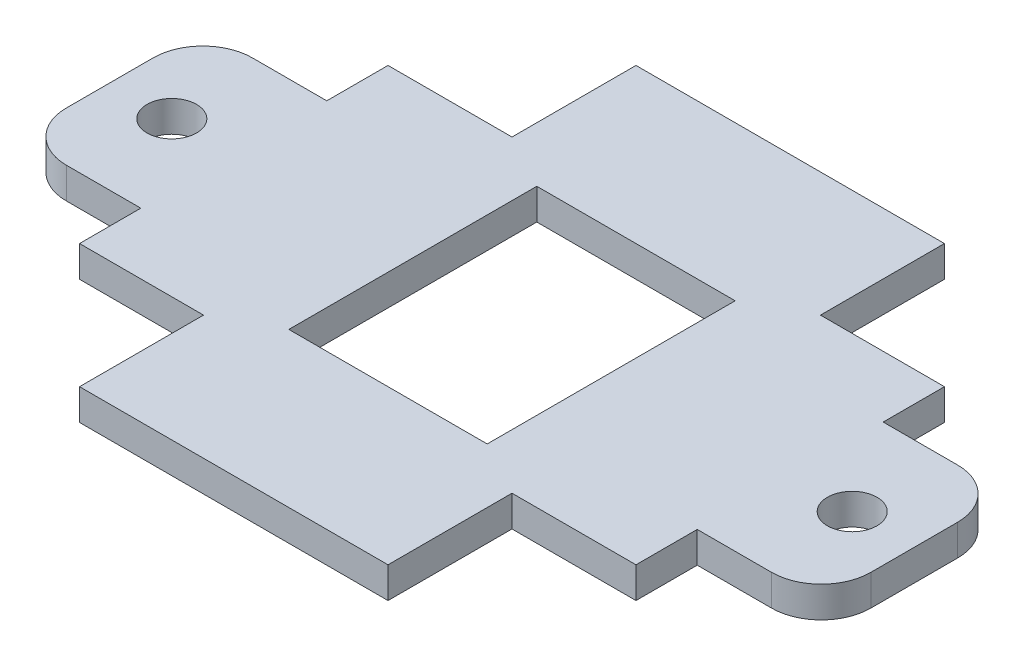
ISO-10303-21;
HEADER;
FILE_DESCRIPTION(('STEP AP214'),'2;1');
FILE_NAME('part.step','',(''),(''),'','','');
FILE_SCHEMA(('AUTOMOTIVE_DESIGN { 1 0 10303 214 1 1 1 1 }'));
ENDSEC;
DATA;
#1=APPLICATION_CONTEXT('core data for automotive mechanical design processes');
#2=APPLICATION_PROTOCOL_DEFINITION('international standard','automotive_design',2000,#1);
#3=PRODUCT_CONTEXT('',#1,'mechanical');
#4=PRODUCT('Part','Part','',(#3));
#5=PRODUCT_RELATED_PRODUCT_CATEGORY('part','',(#4));
#6=PRODUCT_DEFINITION_FORMATION('','',#4);
#7=PRODUCT_DEFINITION_CONTEXT('part definition',#1,'design');
#8=PRODUCT_DEFINITION('design','',#6,#7);
#9=PRODUCT_DEFINITION_SHAPE('','',#8);
#10=(LENGTH_UNIT() NAMED_UNIT(*) SI_UNIT(.MILLI.,.METRE.));
#11=(NAMED_UNIT(*) PLANE_ANGLE_UNIT() SI_UNIT($,.RADIAN.));
#12=(NAMED_UNIT(*) SI_UNIT($,.STERADIAN.) SOLID_ANGLE_UNIT());
#13=UNCERTAINTY_MEASURE_WITH_UNIT(LENGTH_MEASURE(1.E-05),#10,'distance_accuracy_value','');
#14=(GEOMETRIC_REPRESENTATION_CONTEXT(3) GLOBAL_UNCERTAINTY_ASSIGNED_CONTEXT((#13)) GLOBAL_UNIT_ASSIGNED_CONTEXT((#10,
#11,#12)) REPRESENTATION_CONTEXT('',''));
#15=CARTESIAN_POINT('',(0.,0.,0.));
#16=DIRECTION('',(0.,0.,1.));
#17=DIRECTION('',(1.,0.,0.));
#18=AXIS2_PLACEMENT_3D('',#15,#16,#17);
#19=CARTESIAN_POINT('',(-36.1199938,3.175,-4.44499999999998));
#20=DIRECTION('',(0.,1.,0.));
#21=DIRECTION('',(0.,0.,1.));
#22=AXIS2_PLACEMENT_3D('',#19,#20,#21);
#23=PLANE('',#22);
#24=CARTESIAN_POINT('',(-34.8499938,3.175,0.));
#25=DIRECTION('',(0.,1.,0.));
#26=DIRECTION('',(0.,0.,1.));
#27=AXIS2_PLACEMENT_3D('',#24,#25,#26);
#28=CIRCLE('',#27,2.54);
#29=CARTESIAN_POINT('',(-34.8499938,3.175,2.54000000000002));
#30=VERTEX_POINT('',#29);
#31=EDGE_CURVE('E249',#30,#30,#28,.T.);
#32=ORIENTED_EDGE('',*,*,#31,.F.);
#33=EDGE_LOOP('',(#32));
#34=FACE_BOUND('',#33,.T.);
#35=DIRECTION('',(-1.,0.,0.));
#36=VECTOR('',#35,1.);
#37=CARTESIAN_POINT('',(-28.4999938,3.175,-9.52499999999998));
#38=LINE('',#37,#36);
#39=CARTESIAN_POINT('',(-28.4999938,3.175,-9.52499999999998));
#40=VERTEX_POINT('',#39);
#41=CARTESIAN_POINT('',(-36.1199938000001,3.175,-9.52499999999998));
#42=VERTEX_POINT('',#41);
#43=EDGE_CURVE('E259',#40,#42,#38,.T.);
#44=ORIENTED_EDGE('',*,*,#43,.T.);
#45=CARTESIAN_POINT('',(-36.1199938,3.175,-4.44499999999998));
#46=DIRECTION('',(0.,1.,0.));
#47=DIRECTION('',(0.,0.,1.));
#48=AXIS2_PLACEMENT_3D('',#45,#46,#47);
#49=CIRCLE('',#48,5.08);
#50=CARTESIAN_POINT('',(-41.1999938,3.175,-4.44499999999998));
#51=VERTEX_POINT('',#50);
#52=EDGE_CURVE('E262',#42,#51,#49,.T.);
#53=ORIENTED_EDGE('',*,*,#52,.T.);
#54=DIRECTION('',(0.,0.,1.));
#55=VECTOR('',#54,1.);
#56=CARTESIAN_POINT('',(-41.1999938,3.175,4.44500000000002));
#57=LINE('',#56,#55);
#58=CARTESIAN_POINT('',(-41.1999938,3.175,4.44500000000002));
#59=VERTEX_POINT('',#58);
#60=EDGE_CURVE('E265',#51,#59,#57,.T.);
#61=ORIENTED_EDGE('',*,*,#60,.T.);
#62=CARTESIAN_POINT('',(-36.1199938,3.175,4.44500000000002));
#63=DIRECTION('',(0.,1.,0.));
#64=DIRECTION('',(0.,0.,-1.));
#65=AXIS2_PLACEMENT_3D('',#62,#63,#64);
#66=CIRCLE('',#65,5.08);
#67=CARTESIAN_POINT('',(-36.1199938000001,3.175,9.52500000000002));
#68=VERTEX_POINT('',#67);
#69=EDGE_CURVE('E267',#59,#68,#66,.T.);
#70=ORIENTED_EDGE('',*,*,#69,.T.);
#71=DIRECTION('',(1.,0.,0.));
#72=VECTOR('',#71,1.);
#73=CARTESIAN_POINT('',(-28.4999938,3.175,9.52500000000002));
#74=LINE('',#73,#72);
#75=CARTESIAN_POINT('',(-28.4999938,3.175,9.52500000000002));
#76=VERTEX_POINT('',#75);
#77=EDGE_CURVE('E269',#68,#76,#74,.T.);
#78=ORIENTED_EDGE('',*,*,#77,.T.);
#79=DIRECTION('',(0.,0.,1.));
#80=VECTOR('',#79,1.);
#81=CARTESIAN_POINT('',(-28.4999938,3.175,9.52500000000002));
#82=LINE('',#81,#80);
#83=CARTESIAN_POINT('',(-28.4999938,3.175,15.7999938));
#84=VERTEX_POINT('',#83);
#85=EDGE_CURVE('E271',#76,#84,#82,.T.);
#86=ORIENTED_EDGE('',*,*,#85,.T.);
#87=DIRECTION('',(1.,0.,0.));
#88=VECTOR('',#87,1.);
#89=CARTESIAN_POINT('',(-15.7999938,3.175,15.7999938));
#90=LINE('',#89,#88);
#91=CARTESIAN_POINT('',(-15.7999938,3.175,15.7999938));
#92=VERTEX_POINT('',#91);
#93=EDGE_CURVE('E273',#84,#92,#90,.T.);
#94=ORIENTED_EDGE('',*,*,#93,.T.);
#95=DIRECTION('',(0.,0.,1.));
#96=VECTOR('',#95,1.);
#97=CARTESIAN_POINT('',(-15.7999938,3.175,15.7999938));
#98=LINE('',#97,#96);
#99=CARTESIAN_POINT('',(-15.7999938,3.175,28.4999938));
#100=VERTEX_POINT('',#99);
#101=EDGE_CURVE('E275',#92,#100,#98,.T.);
#102=ORIENTED_EDGE('',*,*,#101,.T.);
#103=DIRECTION('',(1.,0.,0.));
#104=VECTOR('',#103,1.);
#105=CARTESIAN_POINT('',(15.7999938,3.175,28.4999938));
#106=LINE('',#105,#104);
#107=CARTESIAN_POINT('',(15.7999938,3.175,28.4999938));
#108=VERTEX_POINT('',#107);
#109=EDGE_CURVE('E277',#100,#108,#106,.T.);
#110=ORIENTED_EDGE('',*,*,#109,.T.);
#111=DIRECTION('',(0.,0.,-1.));
#112=VECTOR('',#111,1.);
#113=CARTESIAN_POINT('',(15.7999938,3.175,15.7999938));
#114=LINE('',#113,#112);
#115=CARTESIAN_POINT('',(15.7999938,3.175,15.7999938));
#116=VERTEX_POINT('',#115);
#117=EDGE_CURVE('E279',#108,#116,#114,.T.);
#118=ORIENTED_EDGE('',*,*,#117,.T.);
#119=DIRECTION('',(1.,0.,0.));
#120=VECTOR('',#119,1.);
#121=CARTESIAN_POINT('',(15.7999938,3.175,15.7999938));
#122=LINE('',#121,#120);
#123=CARTESIAN_POINT('',(28.4999938,3.175,15.7999938));
#124=VERTEX_POINT('',#123);
#125=EDGE_CURVE('E281',#116,#124,#122,.T.);
#126=ORIENTED_EDGE('',*,*,#125,.T.);
#127=DIRECTION('',(0.,0.,-1.));
#128=VECTOR('',#127,1.);
#129=CARTESIAN_POINT('',(28.4999938,3.175,9.52500000000002));
#130=LINE('',#129,#128);
#131=CARTESIAN_POINT('',(28.4999938,3.175,9.52500000000002));
#132=VERTEX_POINT('',#131);
#133=EDGE_CURVE('E283',#124,#132,#130,.T.);
#134=ORIENTED_EDGE('',*,*,#133,.T.);
#135=DIRECTION('',(1.,0.,0.));
#136=VECTOR('',#135,1.);
#137=CARTESIAN_POINT('',(28.4999938,3.175,9.52500000000002));
#138=LINE('',#137,#136);
#139=CARTESIAN_POINT('',(36.1199938,3.175,9.52500000000002));
#140=VERTEX_POINT('',#139);
#141=EDGE_CURVE('E285',#132,#140,#138,.T.);
#142=ORIENTED_EDGE('',*,*,#141,.T.);
#143=CARTESIAN_POINT('',(36.1199938,3.175,4.44500000000002));
#144=DIRECTION('',(0.,1.,0.));
#145=DIRECTION('',(0.,0.,1.));
#146=AXIS2_PLACEMENT_3D('',#143,#144,#145);
#147=CIRCLE('',#146,5.08);
#148=CARTESIAN_POINT('',(41.1999938,3.175,4.44500000000001));
#149=VERTEX_POINT('',#148);
#150=EDGE_CURVE('E287',#140,#149,#147,.T.);
#151=ORIENTED_EDGE('',*,*,#150,.T.);
#152=DIRECTION('',(0.,0.,-1.));
#153=VECTOR('',#152,1.);
#154=CARTESIAN_POINT('',(41.1999938,3.175,4.44500000000001));
#155=LINE('',#154,#153);
#156=CARTESIAN_POINT('',(41.1999938,3.175,-4.44499999999999));
#157=VERTEX_POINT('',#156);
#158=EDGE_CURVE('E289',#149,#157,#155,.T.);
#159=ORIENTED_EDGE('',*,*,#158,.T.);
#160=CARTESIAN_POINT('',(36.1199938,3.175,-4.44499999999999));
#161=DIRECTION('',(0.,1.,0.));
#162=DIRECTION('',(0.,0.,1.));
#163=AXIS2_PLACEMENT_3D('',#160,#161,#162);
#164=CIRCLE('',#163,5.08000000000001);
#165=CARTESIAN_POINT('',(36.1199938,3.175,-9.52499999999999));
#166=VERTEX_POINT('',#165);
#167=EDGE_CURVE('E291',#157,#166,#164,.T.);
#168=ORIENTED_EDGE('',*,*,#167,.T.);
#169=DIRECTION('',(-1.,0.,0.));
#170=VECTOR('',#169,1.);
#171=CARTESIAN_POINT('',(28.4999938,3.175,-9.52499999999998));
#172=LINE('',#171,#170);
#173=CARTESIAN_POINT('',(28.4999938,3.175,-9.52499999999998));
#174=VERTEX_POINT('',#173);
#175=EDGE_CURVE('E293',#166,#174,#172,.T.);
#176=ORIENTED_EDGE('',*,*,#175,.T.);
#177=DIRECTION('',(0.,0.,-1.));
#178=VECTOR('',#177,1.);
#179=CARTESIAN_POINT('',(28.4999938,3.175,-15.7999938));
#180=LINE('',#179,#178);
#181=CARTESIAN_POINT('',(28.4999938,3.175,-15.7999938));
#182=VERTEX_POINT('',#181);
#183=EDGE_CURVE('E295',#174,#182,#180,.T.);
#184=ORIENTED_EDGE('',*,*,#183,.T.);
#185=DIRECTION('',(-1.,0.,0.));
#186=VECTOR('',#185,1.);
#187=CARTESIAN_POINT('',(15.7999938,3.175,-15.7999938));
#188=LINE('',#187,#186);
#189=CARTESIAN_POINT('',(15.7999938,3.175,-15.7999938));
#190=VERTEX_POINT('',#189);
#191=EDGE_CURVE('E297',#182,#190,#188,.T.);
#192=ORIENTED_EDGE('',*,*,#191,.T.);
#193=DIRECTION('',(0.,0.,-1.));
#194=VECTOR('',#193,1.);
#195=CARTESIAN_POINT('',(15.7999938,3.175,-15.7999938));
#196=LINE('',#195,#194);
#197=CARTESIAN_POINT('',(15.7999938,3.175,-28.4999938));
#198=VERTEX_POINT('',#197);
#199=EDGE_CURVE('E299',#190,#198,#196,.T.);
#200=ORIENTED_EDGE('',*,*,#199,.T.);
#201=DIRECTION('',(-1.,0.,0.));
#202=VECTOR('',#201,1.);
#203=CARTESIAN_POINT('',(-15.7999938,3.175,-28.4999938));
#204=LINE('',#203,#202);
#205=CARTESIAN_POINT('',(-15.7999938,3.175,-28.4999938));
#206=VERTEX_POINT('',#205);
#207=EDGE_CURVE('E301',#198,#206,#204,.T.);
#208=ORIENTED_EDGE('',*,*,#207,.T.);
#209=DIRECTION('',(0.,0.,1.));
#210=VECTOR('',#209,1.);
#211=CARTESIAN_POINT('',(-15.7999938,3.175,-15.7999938));
#212=LINE('',#211,#210);
#213=CARTESIAN_POINT('',(-15.7999938,3.175,-15.7999938));
#214=VERTEX_POINT('',#213);
#215=EDGE_CURVE('E303',#206,#214,#212,.T.);
#216=ORIENTED_EDGE('',*,*,#215,.T.);
#217=DIRECTION('',(-1.,0.,0.));
#218=VECTOR('',#217,1.);
#219=CARTESIAN_POINT('',(-15.7999938,3.175,-15.7999938));
#220=LINE('',#219,#218);
#221=CARTESIAN_POINT('',(-28.4999938,3.175,-15.7999938));
#222=VERTEX_POINT('',#221);
#223=EDGE_CURVE('E305',#214,#222,#220,.T.);
#224=ORIENTED_EDGE('',*,*,#223,.T.);
#225=DIRECTION('',(0.,0.,1.));
#226=VECTOR('',#225,1.);
#227=CARTESIAN_POINT('',(-28.4999938,3.175,-15.7999938));
#228=LINE('',#227,#226);
#229=EDGE_CURVE('E307',#222,#40,#228,.T.);
#230=ORIENTED_EDGE('',*,*,#229,.T.);
#231=EDGE_LOOP('',(#44,#53,#61,#70,#78,#86,#94,#102,#110,#118,#126,#134,#142,#151,#159,#168,
#176,#184,#192,#200,#208,#216,#224,#230));
#232=FACE_BOUND('',#231,.T.);
#233=DIRECTION('',(1.,0.,0.));
#234=VECTOR('',#233,1.);
#235=CARTESIAN_POINT('',(10.16,3.175,12.7));
#236=LINE('',#235,#234);
#237=CARTESIAN_POINT('',(-10.16,3.175,12.7));
#238=VERTEX_POINT('',#237);
#239=CARTESIAN_POINT('',(10.16,3.175,12.7));
#240=VERTEX_POINT('',#239);
#241=EDGE_CURVE('E228',#238,#240,#236,.T.);
#242=ORIENTED_EDGE('',*,*,#241,.F.);
#243=DIRECTION('',(0.,0.,1.));
#244=VECTOR('',#243,1.);
#245=CARTESIAN_POINT('',(-10.16,3.175,12.7));
#246=LINE('',#245,#244);
#247=CARTESIAN_POINT('',(-10.16,3.175,-12.7));
#248=VERTEX_POINT('',#247);
#249=EDGE_CURVE('E220',#248,#238,#246,.T.);
#250=ORIENTED_EDGE('',*,*,#249,.F.);
#251=DIRECTION('',(-1.,0.,0.));
#252=VECTOR('',#251,1.);
#253=CARTESIAN_POINT('',(10.16,3.175,-12.7));
#254=LINE('',#253,#252);
#255=CARTESIAN_POINT('',(10.16,3.175,-12.7));
#256=VERTEX_POINT('',#255);
#257=EDGE_CURVE('E243',#256,#248,#254,.T.);
#258=ORIENTED_EDGE('',*,*,#257,.F.);
#259=DIRECTION('',(0.,0.,-1.));
#260=VECTOR('',#259,1.);
#261=CARTESIAN_POINT('',(10.16,3.175,12.7));
#262=LINE('',#261,#260);
#263=EDGE_CURVE('E241',#240,#256,#262,.T.);
#264=ORIENTED_EDGE('',*,*,#263,.F.);
#265=EDGE_LOOP('',(#242,#250,#258,#264));
#266=FACE_BOUND('',#265,.T.);
#267=CARTESIAN_POINT('',(34.8499938,3.175,0.));
#268=DIRECTION('',(0.,1.,0.));
#269=DIRECTION('',(0.,0.,-1.));
#270=AXIS2_PLACEMENT_3D('',#267,#268,#269);
#271=CIRCLE('',#270,2.54000000000002);
#272=CARTESIAN_POINT('',(34.8499938,3.175,-2.54));
#273=VERTEX_POINT('',#272);
#274=EDGE_CURVE('E809',#273,#273,#271,.T.);
#275=ORIENTED_EDGE('',*,*,#274,.F.);
#276=EDGE_LOOP('',(#275));
#277=FACE_BOUND('',#276,.T.);
#278=ADVANCED_FACE('F35',(#34,#232,#266,#277),#23,.T.);
#279=CARTESIAN_POINT('',(-36.1199938,0.,-4.44499999999998));
#280=DIRECTION('',(0.,1.,0.));
#281=DIRECTION('',(0.,0.,1.));
#282=AXIS2_PLACEMENT_3D('',#279,#280,#281);
#283=PLANE('',#282);
#284=DIRECTION('',(-1.,0.,0.));
#285=VECTOR('',#284,1.);
#286=CARTESIAN_POINT('',(-28.4999938,0.,-9.52499999999998));
#287=LINE('',#286,#285);
#288=CARTESIAN_POINT('',(-28.4999938,0.,-9.52499999999998));
#289=VERTEX_POINT('',#288);
#290=CARTESIAN_POINT('',(-36.1199938000001,0.,-9.52499999999998));
#291=VERTEX_POINT('',#290);
#292=EDGE_CURVE('E236',#289,#291,#287,.T.);
#293=ORIENTED_EDGE('',*,*,#292,.F.);
#294=DIRECTION('',(0.,0.,1.));
#295=VECTOR('',#294,1.);
#296=CARTESIAN_POINT('',(-28.4999938,0.,-15.7999938));
#297=LINE('',#296,#295);
#298=CARTESIAN_POINT('',(-28.4999938,0.,-15.7999938));
#299=VERTEX_POINT('',#298);
#300=EDGE_CURVE('E263',#299,#289,#297,.T.);
#301=ORIENTED_EDGE('',*,*,#300,.F.);
#302=DIRECTION('',(-1.,0.,0.));
#303=VECTOR('',#302,1.);
#304=CARTESIAN_POINT('',(-15.7999938,0.,-15.7999938));
#305=LINE('',#304,#303);
#306=CARTESIAN_POINT('',(-15.7999938,0.,-15.7999938));
#307=VERTEX_POINT('',#306);
#308=EDGE_CURVE('E354',#307,#299,#305,.T.);
#309=ORIENTED_EDGE('',*,*,#308,.F.);
#310=DIRECTION('',(0.,0.,1.));
#311=VECTOR('',#310,1.);
#312=CARTESIAN_POINT('',(-15.7999938,0.,-15.7999938));
#313=LINE('',#312,#311);
#314=CARTESIAN_POINT('',(-15.7999938,0.,-28.4999938));
#315=VERTEX_POINT('',#314);
#316=EDGE_CURVE('E352',#315,#307,#313,.T.);
#317=ORIENTED_EDGE('',*,*,#316,.F.);
#318=DIRECTION('',(-1.,0.,0.));
#319=VECTOR('',#318,1.);
#320=CARTESIAN_POINT('',(-15.7999938,0.,-28.4999938));
#321=LINE('',#320,#319);
#322=CARTESIAN_POINT('',(15.7999938,0.,-28.4999938));
#323=VERTEX_POINT('',#322);
#324=EDGE_CURVE('E350',#323,#315,#321,.T.);
#325=ORIENTED_EDGE('',*,*,#324,.F.);
#326=DIRECTION('',(0.,0.,-1.));
#327=VECTOR('',#326,1.);
#328=CARTESIAN_POINT('',(15.7999938,0.,-15.7999938));
#329=LINE('',#328,#327);
#330=CARTESIAN_POINT('',(15.7999938,0.,-15.7999938));
#331=VERTEX_POINT('',#330);
#332=EDGE_CURVE('E348',#331,#323,#329,.T.);
#333=ORIENTED_EDGE('',*,*,#332,.F.);
#334=DIRECTION('',(-1.,0.,0.));
#335=VECTOR('',#334,1.);
#336=CARTESIAN_POINT('',(15.7999938,0.,-15.7999938));
#337=LINE('',#336,#335);
#338=CARTESIAN_POINT('',(28.4999938,0.,-15.7999938));
#339=VERTEX_POINT('',#338);
#340=EDGE_CURVE('E346',#339,#331,#337,.T.);
#341=ORIENTED_EDGE('',*,*,#340,.F.);
#342=DIRECTION('',(0.,0.,-1.));
#343=VECTOR('',#342,1.);
#344=CARTESIAN_POINT('',(28.4999938,0.,-15.7999938));
#345=LINE('',#344,#343);
#346=CARTESIAN_POINT('',(28.4999938,0.,-9.52499999999998));
#347=VERTEX_POINT('',#346);
#348=EDGE_CURVE('E344',#347,#339,#345,.T.);
#349=ORIENTED_EDGE('',*,*,#348,.F.);
#350=DIRECTION('',(-1.,0.,0.));
#351=VECTOR('',#350,1.);
#352=CARTESIAN_POINT('',(28.4999938,0.,-9.52499999999998));
#353=LINE('',#352,#351);
#354=CARTESIAN_POINT('',(36.1199938,0.,-9.52499999999999));
#355=VERTEX_POINT('',#354);
#356=EDGE_CURVE('E342',#355,#347,#353,.T.);
#357=ORIENTED_EDGE('',*,*,#356,.F.);
#358=CARTESIAN_POINT('',(36.1199938,0.,-4.44499999999999));
#359=DIRECTION('',(0.,1.,0.));
#360=DIRECTION('',(0.,0.,1.));
#361=AXIS2_PLACEMENT_3D('',#358,#359,#360);
#362=CIRCLE('',#361,5.08000000000001);
#363=CARTESIAN_POINT('',(41.1999938,0.,-4.44499999999999));
#364=VERTEX_POINT('',#363);
#365=EDGE_CURVE('E340',#364,#355,#362,.T.);
#366=ORIENTED_EDGE('',*,*,#365,.F.);
#367=DIRECTION('',(0.,0.,-1.));
#368=VECTOR('',#367,1.);
#369=CARTESIAN_POINT('',(41.1999938,0.,4.44500000000001));
#370=LINE('',#369,#368);
#371=CARTESIAN_POINT('',(41.1999938,0.,4.44500000000001));
#372=VERTEX_POINT('',#371);
#373=EDGE_CURVE('E338',#372,#364,#370,.T.);
#374=ORIENTED_EDGE('',*,*,#373,.F.);
#375=CARTESIAN_POINT('',(36.1199938,0.,4.44500000000002));
#376=DIRECTION('',(0.,1.,0.));
#377=DIRECTION('',(0.,0.,1.));
#378=AXIS2_PLACEMENT_3D('',#375,#376,#377);
#379=CIRCLE('',#378,5.08);
#380=CARTESIAN_POINT('',(36.1199938,0.,9.52500000000002));
#381=VERTEX_POINT('',#380);
#382=EDGE_CURVE('E336',#381,#372,#379,.T.);
#383=ORIENTED_EDGE('',*,*,#382,.F.);
#384=DIRECTION('',(1.,0.,0.));
#385=VECTOR('',#384,1.);
#386=CARTESIAN_POINT('',(28.4999938,0.,9.52500000000002));
#387=LINE('',#386,#385);
#388=CARTESIAN_POINT('',(28.4999938,0.,9.52500000000002));
#389=VERTEX_POINT('',#388);
#390=EDGE_CURVE('E334',#389,#381,#387,.T.);
#391=ORIENTED_EDGE('',*,*,#390,.F.);
#392=DIRECTION('',(0.,0.,-1.));
#393=VECTOR('',#392,1.);
#394=CARTESIAN_POINT('',(28.4999938,0.,9.52500000000002));
#395=LINE('',#394,#393);
#396=CARTESIAN_POINT('',(28.4999938,0.,15.7999938));
#397=VERTEX_POINT('',#396);
#398=EDGE_CURVE('E332',#397,#389,#395,.T.);
#399=ORIENTED_EDGE('',*,*,#398,.F.);
#400=DIRECTION('',(1.,0.,0.));
#401=VECTOR('',#400,1.);
#402=CARTESIAN_POINT('',(15.7999938,0.,15.7999938));
#403=LINE('',#402,#401);
#404=CARTESIAN_POINT('',(15.7999938,0.,15.7999938));
#405=VERTEX_POINT('',#404);
#406=EDGE_CURVE('E330',#405,#397,#403,.T.);
#407=ORIENTED_EDGE('',*,*,#406,.F.);
#408=DIRECTION('',(0.,0.,-1.));
#409=VECTOR('',#408,1.);
#410=CARTESIAN_POINT('',(15.7999938,0.,15.7999938));
#411=LINE('',#410,#409);
#412=CARTESIAN_POINT('',(15.7999938,0.,28.4999938));
#413=VERTEX_POINT('',#412);
#414=EDGE_CURVE('E328',#413,#405,#411,.T.);
#415=ORIENTED_EDGE('',*,*,#414,.F.);
#416=DIRECTION('',(1.,0.,0.));
#417=VECTOR('',#416,1.);
#418=CARTESIAN_POINT('',(15.7999938,0.,28.4999938));
#419=LINE('',#418,#417);
#420=CARTESIAN_POINT('',(-15.7999938,0.,28.4999938));
#421=VERTEX_POINT('',#420);
#422=EDGE_CURVE('E326',#421,#413,#419,.T.);
#423=ORIENTED_EDGE('',*,*,#422,.F.);
#424=DIRECTION('',(0.,0.,1.));
#425=VECTOR('',#424,1.);
#426=CARTESIAN_POINT('',(-15.7999938,0.,15.7999938));
#427=LINE('',#426,#425);
#428=CARTESIAN_POINT('',(-15.7999938,0.,15.7999938));
#429=VERTEX_POINT('',#428);
#430=EDGE_CURVE('E324',#429,#421,#427,.T.);
#431=ORIENTED_EDGE('',*,*,#430,.F.);
#432=DIRECTION('',(1.,0.,0.));
#433=VECTOR('',#432,1.);
#434=CARTESIAN_POINT('',(-15.7999938,0.,15.7999938));
#435=LINE('',#434,#433);
#436=CARTESIAN_POINT('',(-28.4999938,0.,15.7999938));
#437=VERTEX_POINT('',#436);
#438=EDGE_CURVE('E322',#437,#429,#435,.T.);
#439=ORIENTED_EDGE('',*,*,#438,.F.);
#440=DIRECTION('',(0.,0.,1.));
#441=VECTOR('',#440,1.);
#442=CARTESIAN_POINT('',(-28.4999938,0.,9.52500000000002));
#443=LINE('',#442,#441);
#444=CARTESIAN_POINT('',(-28.4999938,0.,9.52500000000002));
#445=VERTEX_POINT('',#444);
#446=EDGE_CURVE('E320',#445,#437,#443,.T.);
#447=ORIENTED_EDGE('',*,*,#446,.F.);
#448=DIRECTION('',(1.,0.,0.));
#449=VECTOR('',#448,1.);
#450=CARTESIAN_POINT('',(-28.4999938,0.,9.52500000000002));
#451=LINE('',#450,#449);
#452=CARTESIAN_POINT('',(-36.1199938000001,0.,9.52500000000002));
#453=VERTEX_POINT('',#452);
#454=EDGE_CURVE('E318',#453,#445,#451,.T.);
#455=ORIENTED_EDGE('',*,*,#454,.F.);
#456=CARTESIAN_POINT('',(-36.1199938,0.,4.44500000000002));
#457=DIRECTION('',(0.,1.,0.));
#458=DIRECTION('',(0.,0.,-1.));
#459=AXIS2_PLACEMENT_3D('',#456,#457,#458);
#460=CIRCLE('',#459,5.08);
#461=CARTESIAN_POINT('',(-41.1999938,0.,4.44500000000002));
#462=VERTEX_POINT('',#461);
#463=EDGE_CURVE('E316',#462,#453,#460,.T.);
#464=ORIENTED_EDGE('',*,*,#463,.F.);
#465=DIRECTION('',(0.,0.,1.));
#466=VECTOR('',#465,1.);
#467=CARTESIAN_POINT('',(-41.1999938,0.,4.44500000000002));
#468=LINE('',#467,#466);
#469=CARTESIAN_POINT('',(-41.1999938,0.,-4.44499999999998));
#470=VERTEX_POINT('',#469);
#471=EDGE_CURVE('E314',#470,#462,#468,.T.);
#472=ORIENTED_EDGE('',*,*,#471,.F.);
#473=CARTESIAN_POINT('',(-36.1199938,0.,-4.44499999999998));
#474=DIRECTION('',(0.,1.,0.));
#475=DIRECTION('',(0.,0.,1.));
#476=AXIS2_PLACEMENT_3D('',#473,#474,#475);
#477=CIRCLE('',#476,5.08);
#478=EDGE_CURVE('E312',#291,#470,#477,.T.);
#479=ORIENTED_EDGE('',*,*,#478,.F.);
#480=EDGE_LOOP('',(#293,#301,#309,#317,#325,#333,#341,#349,#357,#366,#374,#383,#391,#399,#407,
#415,#423,#431,#439,#447,#455,#464,#472,#479));
#481=FACE_BOUND('',#480,.T.);
#482=DIRECTION('',(0.,0.,1.));
#483=VECTOR('',#482,1.);
#484=CARTESIAN_POINT('',(-10.16,0.,12.7));
#485=LINE('',#484,#483);
#486=CARTESIAN_POINT('',(-10.16,0.,-12.7));
#487=VERTEX_POINT('',#486);
#488=CARTESIAN_POINT('',(-10.16,0.,12.7));
#489=VERTEX_POINT('',#488);
#490=EDGE_CURVE('E58',#487,#489,#485,.T.);
#491=ORIENTED_EDGE('',*,*,#490,.T.);
#492=DIRECTION('',(1.,0.,0.));
#493=VECTOR('',#492,1.);
#494=CARTESIAN_POINT('',(10.16,0.,12.7));
#495=LINE('',#494,#493);
#496=CARTESIAN_POINT('',(10.16,0.,12.7));
#497=VERTEX_POINT('',#496);
#498=EDGE_CURVE('E235',#489,#497,#495,.T.);
#499=ORIENTED_EDGE('',*,*,#498,.T.);
#500=DIRECTION('',(0.,0.,-1.));
#501=VECTOR('',#500,1.);
#502=CARTESIAN_POINT('',(10.16,0.,12.7));
#503=LINE('',#502,#501);
#504=CARTESIAN_POINT('',(10.16,0.,-12.7));
#505=VERTEX_POINT('',#504);
#506=EDGE_CURVE('E251',#497,#505,#503,.T.);
#507=ORIENTED_EDGE('',*,*,#506,.T.);
#508=DIRECTION('',(-1.,0.,0.));
#509=VECTOR('',#508,1.);
#510=CARTESIAN_POINT('',(10.16,0.,-12.7));
#511=LINE('',#510,#509);
#512=EDGE_CURVE('E229',#505,#487,#511,.T.);
#513=ORIENTED_EDGE('',*,*,#512,.T.);
#514=EDGE_LOOP('',(#491,#499,#507,#513));
#515=FACE_BOUND('',#514,.T.);
#516=CARTESIAN_POINT('',(-34.8499938,0.,0.));
#517=DIRECTION('',(0.,1.,0.));
#518=DIRECTION('',(0.,0.,1.));
#519=AXIS2_PLACEMENT_3D('',#516,#517,#518);
#520=CIRCLE('',#519,2.54);
#521=CARTESIAN_POINT('',(-34.8499938,0.,2.54000000000002));
#522=VERTEX_POINT('',#521);
#523=EDGE_CURVE('E815',#522,#522,#520,.T.);
#524=ORIENTED_EDGE('',*,*,#523,.T.);
#525=EDGE_LOOP('',(#524));
#526=FACE_BOUND('',#525,.T.);
#527=CARTESIAN_POINT('',(34.8499938,0.,0.));
#528=DIRECTION('',(0.,1.,0.));
#529=DIRECTION('',(0.,0.,-1.));
#530=AXIS2_PLACEMENT_3D('',#527,#528,#529);
#531=CIRCLE('',#530,2.54000000000002);
#532=CARTESIAN_POINT('',(34.8499938,0.,-2.54));
#533=VERTEX_POINT('',#532);
#534=EDGE_CURVE('E812',#533,#533,#531,.T.);
#535=ORIENTED_EDGE('',*,*,#534,.T.);
#536=EDGE_LOOP('',(#535));
#537=FACE_BOUND('',#536,.T.);
#538=ADVANCED_FACE('F432',(#481,#515,#526,#537),#283,.F.);
#539=CARTESIAN_POINT('',(-28.4999938,3.175,-9.52499999999998));
#540=DIRECTION('',(0.,0.,1.));
#541=DIRECTION('',(1.,0.,0.));
#542=AXIS2_PLACEMENT_3D('',#539,#540,#541);
#543=PLANE('',#542);
#544=ORIENTED_EDGE('',*,*,#292,.T.);
#545=DIRECTION('',(0.,-1.,0.));
#546=VECTOR('',#545,1.);
#547=CARTESIAN_POINT('',(-36.1199938000001,3.175,-9.52499999999998));
#548=LINE('',#547,#546);
#549=EDGE_CURVE('E11',#42,#291,#548,.T.);
#550=ORIENTED_EDGE('',*,*,#549,.F.);
#551=ORIENTED_EDGE('',*,*,#43,.F.);
#552=DIRECTION('',(0.,-1.,0.));
#553=VECTOR('',#552,1.);
#554=CARTESIAN_POINT('',(-28.4999938,3.175,-9.52499999999998));
#555=LINE('',#554,#553);
#556=EDGE_CURVE('E309',#40,#289,#555,.T.);
#557=ORIENTED_EDGE('',*,*,#556,.T.);
#558=EDGE_LOOP('',(#544,#550,#551,#557));
#559=FACE_BOUND('',#558,.T.);
#560=ADVANCED_FACE('F37',(#559),#543,.F.);
#561=CARTESIAN_POINT('',(-36.1199938,3.175,-4.44499999999998));
#562=DIRECTION('',(0.,-1.,0.));
#563=DIRECTION('',(0.,0.,-1.));
#564=AXIS2_PLACEMENT_3D('',#561,#562,#563);
#565=CYLINDRICAL_SURFACE('',#564,5.08);
#566=ORIENTED_EDGE('',*,*,#478,.T.);
#567=DIRECTION('',(0.,-1.,0.));
#568=VECTOR('',#567,1.);
#569=CARTESIAN_POINT('',(-41.1999938,3.175,-4.44499999999998));
#570=LINE('',#569,#568);
#571=EDGE_CURVE('E43',#51,#470,#570,.T.);
#572=ORIENTED_EDGE('',*,*,#571,.F.);
#573=ORIENTED_EDGE('',*,*,#52,.F.);
#574=ORIENTED_EDGE('',*,*,#549,.T.);
#575=EDGE_LOOP('',(#566,#572,#573,#574));
#576=FACE_BOUND('',#575,.T.);
#577=ADVANCED_FACE('F449',(#576),#565,.T.);
#578=CARTESIAN_POINT('',(-41.1999938,3.175,4.44500000000002));
#579=DIRECTION('',(1.,0.,0.));
#580=DIRECTION('',(0.,0.,-1.));
#581=AXIS2_PLACEMENT_3D('',#578,#579,#580);
#582=PLANE('',#581);
#583=ORIENTED_EDGE('',*,*,#471,.T.);
#584=DIRECTION('',(0.,-1.,0.));
#585=VECTOR('',#584,1.);
#586=CARTESIAN_POINT('',(-41.1999938,3.175,4.44500000000002));
#587=LINE('',#586,#585);
#588=EDGE_CURVE('E419',#59,#462,#587,.T.);
#589=ORIENTED_EDGE('',*,*,#588,.F.);
#590=ORIENTED_EDGE('',*,*,#60,.F.);
#591=ORIENTED_EDGE('',*,*,#571,.T.);
#592=EDGE_LOOP('',(#583,#589,#590,#591));
#593=FACE_BOUND('',#592,.T.);
#594=ADVANCED_FACE('F426',(#593),#582,.F.);
#595=CARTESIAN_POINT('',(-36.1199938,3.175,4.44500000000002));
#596=DIRECTION('',(0.,-1.,0.));
#597=DIRECTION('',(0.,0.,-1.));
#598=AXIS2_PLACEMENT_3D('',#595,#596,#597);
#599=CYLINDRICAL_SURFACE('',#598,5.08);
#600=ORIENTED_EDGE('',*,*,#463,.T.);
#601=DIRECTION('',(0.,-1.,0.));
#602=VECTOR('',#601,1.);
#603=CARTESIAN_POINT('',(-36.1199938000001,3.175,9.52500000000002));
#604=LINE('',#603,#602);
#605=EDGE_CURVE('E416',#68,#453,#604,.T.);
#606=ORIENTED_EDGE('',*,*,#605,.F.);
#607=ORIENTED_EDGE('',*,*,#69,.F.);
#608=ORIENTED_EDGE('',*,*,#588,.T.);
#609=EDGE_LOOP('',(#600,#606,#607,#608));
#610=FACE_BOUND('',#609,.T.);
#611=ADVANCED_FACE('F438',(#610),#599,.T.);
#612=CARTESIAN_POINT('',(-28.4999938,3.175,9.52500000000002));
#613=DIRECTION('',(0.,0.,-1.));
#614=DIRECTION('',(-1.,0.,0.));
#615=AXIS2_PLACEMENT_3D('',#612,#613,#614);
#616=PLANE('',#615);
#617=ORIENTED_EDGE('',*,*,#454,.T.);
#618=DIRECTION('',(0.,-1.,0.));
#619=VECTOR('',#618,1.);
#620=CARTESIAN_POINT('',(-28.4999938,3.175,9.52500000000002));
#621=LINE('',#620,#619);
#622=EDGE_CURVE('E413',#76,#445,#621,.T.);
#623=ORIENTED_EDGE('',*,*,#622,.F.);
#624=ORIENTED_EDGE('',*,*,#77,.F.);
#625=ORIENTED_EDGE('',*,*,#605,.T.);
#626=EDGE_LOOP('',(#617,#623,#624,#625));
#627=FACE_BOUND('',#626,.T.);
#628=ADVANCED_FACE('F442',(#627),#616,.F.);
#629=CARTESIAN_POINT('',(-28.4999938,3.175,9.52500000000002));
#630=DIRECTION('',(1.,0.,0.));
#631=DIRECTION('',(0.,0.,-1.));
#632=AXIS2_PLACEMENT_3D('',#629,#630,#631);
#633=PLANE('',#632);
#634=ORIENTED_EDGE('',*,*,#446,.T.);
#635=DIRECTION('',(0.,-1.,0.));
#636=VECTOR('',#635,1.);
#637=CARTESIAN_POINT('',(-28.4999938,3.175,15.7999938));
#638=LINE('',#637,#636);
#639=EDGE_CURVE('E410',#84,#437,#638,.T.);
#640=ORIENTED_EDGE('',*,*,#639,.F.);
#641=ORIENTED_EDGE('',*,*,#85,.F.);
#642=ORIENTED_EDGE('',*,*,#622,.T.);
#643=EDGE_LOOP('',(#634,#640,#641,#642));
#644=FACE_BOUND('',#643,.T.);
#645=ADVANCED_FACE('F542',(#644),#633,.F.);
#646=CARTESIAN_POINT('',(-15.7999938,3.175,15.7999938));
#647=DIRECTION('',(0.,0.,-1.));
#648=DIRECTION('',(-1.,0.,0.));
#649=AXIS2_PLACEMENT_3D('',#646,#647,#648);
#650=PLANE('',#649);
#651=ORIENTED_EDGE('',*,*,#438,.T.);
#652=DIRECTION('',(0.,-1.,0.));
#653=VECTOR('',#652,1.);
#654=CARTESIAN_POINT('',(-15.7999938,3.175,15.7999938));
#655=LINE('',#654,#653);
#656=EDGE_CURVE('E407',#92,#429,#655,.T.);
#657=ORIENTED_EDGE('',*,*,#656,.F.);
#658=ORIENTED_EDGE('',*,*,#93,.F.);
#659=ORIENTED_EDGE('',*,*,#639,.T.);
#660=EDGE_LOOP('',(#651,#657,#658,#659));
#661=FACE_BOUND('',#660,.T.);
#662=ADVANCED_FACE('F540',(#661),#650,.F.);
#663=CARTESIAN_POINT('',(-15.7999938,3.175,15.7999938));
#664=DIRECTION('',(1.,0.,0.));
#665=DIRECTION('',(0.,0.,-1.));
#666=AXIS2_PLACEMENT_3D('',#663,#664,#665);
#667=PLANE('',#666);
#668=ORIENTED_EDGE('',*,*,#430,.T.);
#669=DIRECTION('',(0.,-1.,0.));
#670=VECTOR('',#669,1.);
#671=CARTESIAN_POINT('',(-15.7999938,3.175,28.4999938));
#672=LINE('',#671,#670);
#673=EDGE_CURVE('E404',#100,#421,#672,.T.);
#674=ORIENTED_EDGE('',*,*,#673,.F.);
#675=ORIENTED_EDGE('',*,*,#101,.F.);
#676=ORIENTED_EDGE('',*,*,#656,.T.);
#677=EDGE_LOOP('',(#668,#674,#675,#676));
#678=FACE_BOUND('',#677,.T.);
#679=ADVANCED_FACE('F536',(#678),#667,.F.);
#680=CARTESIAN_POINT('',(15.7999938,3.175,28.4999938));
#681=DIRECTION('',(0.,0.,-1.));
#682=DIRECTION('',(-1.,0.,0.));
#683=AXIS2_PLACEMENT_3D('',#680,#681,#682);
#684=PLANE('',#683);
#685=ORIENTED_EDGE('',*,*,#422,.T.);
#686=DIRECTION('',(0.,-1.,0.));
#687=VECTOR('',#686,1.);
#688=CARTESIAN_POINT('',(15.7999938,3.175,28.4999938));
#689=LINE('',#688,#687);
#690=EDGE_CURVE('E401',#108,#413,#689,.T.);
#691=ORIENTED_EDGE('',*,*,#690,.F.);
#692=ORIENTED_EDGE('',*,*,#109,.F.);
#693=ORIENTED_EDGE('',*,*,#673,.T.);
#694=EDGE_LOOP('',(#685,#691,#692,#693));
#695=FACE_BOUND('',#694,.T.);
#696=ADVANCED_FACE('F531',(#695),#684,.F.);
#697=CARTESIAN_POINT('',(15.7999938,3.175,15.7999938));
#698=DIRECTION('',(-1.,0.,0.));
#699=DIRECTION('',(0.,0.,1.));
#700=AXIS2_PLACEMENT_3D('',#697,#698,#699);
#701=PLANE('',#700);
#702=ORIENTED_EDGE('',*,*,#414,.T.);
#703=DIRECTION('',(0.,-1.,0.));
#704=VECTOR('',#703,1.);
#705=CARTESIAN_POINT('',(15.7999938,3.175,15.7999938));
#706=LINE('',#705,#704);
#707=EDGE_CURVE('E398',#116,#405,#706,.T.);
#708=ORIENTED_EDGE('',*,*,#707,.F.);
#709=ORIENTED_EDGE('',*,*,#117,.F.);
#710=ORIENTED_EDGE('',*,*,#690,.T.);
#711=EDGE_LOOP('',(#702,#708,#709,#710));
#712=FACE_BOUND('',#711,.T.);
#713=ADVANCED_FACE('F525',(#712),#701,.F.);
#714=CARTESIAN_POINT('',(15.7999938,3.175,15.7999938));
#715=DIRECTION('',(0.,0.,-1.));
#716=DIRECTION('',(-1.,0.,0.));
#717=AXIS2_PLACEMENT_3D('',#714,#715,#716);
#718=PLANE('',#717);
#719=ORIENTED_EDGE('',*,*,#406,.T.);
#720=DIRECTION('',(0.,-1.,0.));
#721=VECTOR('',#720,1.);
#722=CARTESIAN_POINT('',(28.4999938,3.175,15.7999938));
#723=LINE('',#722,#721);
#724=EDGE_CURVE('E395',#124,#397,#723,.T.);
#725=ORIENTED_EDGE('',*,*,#724,.F.);
#726=ORIENTED_EDGE('',*,*,#125,.F.);
#727=ORIENTED_EDGE('',*,*,#707,.T.);
#728=EDGE_LOOP('',(#719,#725,#726,#727));
#729=FACE_BOUND('',#728,.T.);
#730=ADVANCED_FACE('F521',(#729),#718,.F.);
#731=CARTESIAN_POINT('',(28.4999938,3.175,9.52500000000002));
#732=DIRECTION('',(-1.,0.,0.));
#733=DIRECTION('',(0.,0.,1.));
#734=AXIS2_PLACEMENT_3D('',#731,#732,#733);
#735=PLANE('',#734);
#736=ORIENTED_EDGE('',*,*,#398,.T.);
#737=DIRECTION('',(0.,-1.,0.));
#738=VECTOR('',#737,1.);
#739=CARTESIAN_POINT('',(28.4999938,3.175,9.52500000000002));
#740=LINE('',#739,#738);
#741=EDGE_CURVE('E392',#132,#389,#740,.T.);
#742=ORIENTED_EDGE('',*,*,#741,.F.);
#743=ORIENTED_EDGE('',*,*,#133,.F.);
#744=ORIENTED_EDGE('',*,*,#724,.T.);
#745=EDGE_LOOP('',(#736,#742,#743,#744));
#746=FACE_BOUND('',#745,.T.);
#747=ADVANCED_FACE('F516',(#746),#735,.F.);
#748=CARTESIAN_POINT('',(28.4999938,3.175,9.52500000000002));
#749=DIRECTION('',(0.,0.,-1.));
#750=DIRECTION('',(-1.,0.,0.));
#751=AXIS2_PLACEMENT_3D('',#748,#749,#750);
#752=PLANE('',#751);
#753=ORIENTED_EDGE('',*,*,#390,.T.);
#754=DIRECTION('',(0.,-1.,0.));
#755=VECTOR('',#754,1.);
#756=CARTESIAN_POINT('',(36.1199938,3.175,9.52500000000002));
#757=LINE('',#756,#755);
#758=EDGE_CURVE('E389',#140,#381,#757,.T.);
#759=ORIENTED_EDGE('',*,*,#758,.F.);
#760=ORIENTED_EDGE('',*,*,#141,.F.);
#761=ORIENTED_EDGE('',*,*,#741,.T.);
#762=EDGE_LOOP('',(#753,#759,#760,#761));
#763=FACE_BOUND('',#762,.T.);
#764=ADVANCED_FACE('F510',(#763),#752,.F.);
#765=CARTESIAN_POINT('',(36.1199938,3.175,4.44500000000002));
#766=DIRECTION('',(0.,-1.,0.));
#767=DIRECTION('',(0.,0.,-1.));
#768=AXIS2_PLACEMENT_3D('',#765,#766,#767);
#769=CYLINDRICAL_SURFACE('',#768,5.08);
#770=ORIENTED_EDGE('',*,*,#382,.T.);
#771=DIRECTION('',(0.,-1.,0.));
#772=VECTOR('',#771,1.);
#773=CARTESIAN_POINT('',(41.1999938,3.175,4.44500000000001));
#774=LINE('',#773,#772);
#775=EDGE_CURVE('E386',#149,#372,#774,.T.);
#776=ORIENTED_EDGE('',*,*,#775,.F.);
#777=ORIENTED_EDGE('',*,*,#150,.F.);
#778=ORIENTED_EDGE('',*,*,#758,.T.);
#779=EDGE_LOOP('',(#770,#776,#777,#778));
#780=FACE_BOUND('',#779,.T.);
#781=ADVANCED_FACE('F506',(#780),#769,.T.);
#782=CARTESIAN_POINT('',(41.1999938,3.175,4.44500000000001));
#783=DIRECTION('',(-1.,0.,0.));
#784=DIRECTION('',(0.,0.,1.));
#785=AXIS2_PLACEMENT_3D('',#782,#783,#784);
#786=PLANE('',#785);
#787=ORIENTED_EDGE('',*,*,#373,.T.);
#788=DIRECTION('',(0.,-1.,0.));
#789=VECTOR('',#788,1.);
#790=CARTESIAN_POINT('',(41.1999938,3.175,-4.44499999999999));
#791=LINE('',#790,#789);
#792=EDGE_CURVE('E383',#157,#364,#791,.T.);
#793=ORIENTED_EDGE('',*,*,#792,.F.);
#794=ORIENTED_EDGE('',*,*,#158,.F.);
#795=ORIENTED_EDGE('',*,*,#775,.T.);
#796=EDGE_LOOP('',(#787,#793,#794,#795));
#797=FACE_BOUND('',#796,.T.);
#798=ADVANCED_FACE('F501',(#797),#786,.F.);
#799=CARTESIAN_POINT('',(36.1199938,3.175,-4.44499999999999));
#800=DIRECTION('',(0.,-1.,0.));
#801=DIRECTION('',(0.,0.,-1.));
#802=AXIS2_PLACEMENT_3D('',#799,#800,#801);
#803=CYLINDRICAL_SURFACE('',#802,5.08000000000001);
#804=ORIENTED_EDGE('',*,*,#365,.T.);
#805=DIRECTION('',(0.,-1.,0.));
#806=VECTOR('',#805,1.);
#807=CARTESIAN_POINT('',(36.1199938,3.175,-9.52499999999999));
#808=LINE('',#807,#806);
#809=EDGE_CURVE('E380',#166,#355,#808,.T.);
#810=ORIENTED_EDGE('',*,*,#809,.F.);
#811=ORIENTED_EDGE('',*,*,#167,.F.);
#812=ORIENTED_EDGE('',*,*,#792,.T.);
#813=EDGE_LOOP('',(#804,#810,#811,#812));
#814=FACE_BOUND('',#813,.T.);
#815=ADVANCED_FACE('F495',(#814),#803,.T.);
#816=CARTESIAN_POINT('',(28.4999938,3.175,-9.52499999999998));
#817=DIRECTION('',(0.,0.,1.));
#818=DIRECTION('',(1.,0.,0.));
#819=AXIS2_PLACEMENT_3D('',#816,#817,#818);
#820=PLANE('',#819);
#821=ORIENTED_EDGE('',*,*,#356,.T.);
#822=DIRECTION('',(0.,-1.,0.));
#823=VECTOR('',#822,1.);
#824=CARTESIAN_POINT('',(28.4999938,3.175,-9.52499999999998));
#825=LINE('',#824,#823);
#826=EDGE_CURVE('E377',#174,#347,#825,.T.);
#827=ORIENTED_EDGE('',*,*,#826,.F.);
#828=ORIENTED_EDGE('',*,*,#175,.F.);
#829=ORIENTED_EDGE('',*,*,#809,.T.);
#830=EDGE_LOOP('',(#821,#827,#828,#829));
#831=FACE_BOUND('',#830,.T.);
#832=ADVANCED_FACE('F491',(#831),#820,.F.);
#833=CARTESIAN_POINT('',(28.4999938,3.175,-15.7999938));
#834=DIRECTION('',(-1.,0.,0.));
#835=DIRECTION('',(0.,0.,1.));
#836=AXIS2_PLACEMENT_3D('',#833,#834,#835);
#837=PLANE('',#836);
#838=ORIENTED_EDGE('',*,*,#348,.T.);
#839=DIRECTION('',(0.,-1.,0.));
#840=VECTOR('',#839,1.);
#841=CARTESIAN_POINT('',(28.4999938,3.175,-15.7999938));
#842=LINE('',#841,#840);
#843=EDGE_CURVE('E374',#182,#339,#842,.T.);
#844=ORIENTED_EDGE('',*,*,#843,.F.);
#845=ORIENTED_EDGE('',*,*,#183,.F.);
#846=ORIENTED_EDGE('',*,*,#826,.T.);
#847=EDGE_LOOP('',(#838,#844,#845,#846));
#848=FACE_BOUND('',#847,.T.);
#849=ADVANCED_FACE('F486',(#848),#837,.F.);
#850=CARTESIAN_POINT('',(15.7999938,3.175,-15.7999938));
#851=DIRECTION('',(0.,0.,1.));
#852=DIRECTION('',(1.,0.,0.));
#853=AXIS2_PLACEMENT_3D('',#850,#851,#852);
#854=PLANE('',#853);
#855=ORIENTED_EDGE('',*,*,#340,.T.);
#856=DIRECTION('',(0.,-1.,0.));
#857=VECTOR('',#856,1.);
#858=CARTESIAN_POINT('',(15.7999938,3.175,-15.7999938));
#859=LINE('',#858,#857);
#860=EDGE_CURVE('E371',#190,#331,#859,.T.);
#861=ORIENTED_EDGE('',*,*,#860,.F.);
#862=ORIENTED_EDGE('',*,*,#191,.F.);
#863=ORIENTED_EDGE('',*,*,#843,.T.);
#864=EDGE_LOOP('',(#855,#861,#862,#863));
#865=FACE_BOUND('',#864,.T.);
#866=ADVANCED_FACE('F480',(#865),#854,.F.);
#867=CARTESIAN_POINT('',(15.7999938,3.175,-15.7999938));
#868=DIRECTION('',(-1.,0.,0.));
#869=DIRECTION('',(0.,0.,1.));
#870=AXIS2_PLACEMENT_3D('',#867,#868,#869);
#871=PLANE('',#870);
#872=ORIENTED_EDGE('',*,*,#332,.T.);
#873=DIRECTION('',(0.,-1.,0.));
#874=VECTOR('',#873,1.);
#875=CARTESIAN_POINT('',(15.7999938,3.175,-28.4999938));
#876=LINE('',#875,#874);
#877=EDGE_CURVE('E368',#198,#323,#876,.T.);
#878=ORIENTED_EDGE('',*,*,#877,.F.);
#879=ORIENTED_EDGE('',*,*,#199,.F.);
#880=ORIENTED_EDGE('',*,*,#860,.T.);
#881=EDGE_LOOP('',(#872,#878,#879,#880));
#882=FACE_BOUND('',#881,.T.);
#883=ADVANCED_FACE('F476',(#882),#871,.F.);
#884=CARTESIAN_POINT('',(-15.7999938,3.175,-28.4999938));
#885=DIRECTION('',(0.,0.,1.));
#886=DIRECTION('',(1.,0.,0.));
#887=AXIS2_PLACEMENT_3D('',#884,#885,#886);
#888=PLANE('',#887);
#889=ORIENTED_EDGE('',*,*,#324,.T.);
#890=DIRECTION('',(0.,-1.,0.));
#891=VECTOR('',#890,1.);
#892=CARTESIAN_POINT('',(-15.7999938,3.175,-28.4999938));
#893=LINE('',#892,#891);
#894=EDGE_CURVE('E365',#206,#315,#893,.T.);
#895=ORIENTED_EDGE('',*,*,#894,.F.);
#896=ORIENTED_EDGE('',*,*,#207,.F.);
#897=ORIENTED_EDGE('',*,*,#877,.T.);
#898=EDGE_LOOP('',(#889,#895,#896,#897));
#899=FACE_BOUND('',#898,.T.);
#900=ADVANCED_FACE('F471',(#899),#888,.F.);
#901=CARTESIAN_POINT('',(-15.7999938,3.175,-15.7999938));
#902=DIRECTION('',(1.,0.,0.));
#903=DIRECTION('',(0.,0.,-1.));
#904=AXIS2_PLACEMENT_3D('',#901,#902,#903);
#905=PLANE('',#904);
#906=ORIENTED_EDGE('',*,*,#316,.T.);
#907=DIRECTION('',(0.,-1.,0.));
#908=VECTOR('',#907,1.);
#909=CARTESIAN_POINT('',(-15.7999938,3.175,-15.7999938));
#910=LINE('',#909,#908);
#911=EDGE_CURVE('E362',#214,#307,#910,.T.);
#912=ORIENTED_EDGE('',*,*,#911,.F.);
#913=ORIENTED_EDGE('',*,*,#215,.F.);
#914=ORIENTED_EDGE('',*,*,#894,.T.);
#915=EDGE_LOOP('',(#906,#912,#913,#914));
#916=FACE_BOUND('',#915,.T.);
#917=ADVANCED_FACE('F465',(#916),#905,.F.);
#918=CARTESIAN_POINT('',(-15.7999938,3.175,-15.7999938));
#919=DIRECTION('',(0.,0.,1.));
#920=DIRECTION('',(1.,0.,0.));
#921=AXIS2_PLACEMENT_3D('',#918,#919,#920);
#922=PLANE('',#921);
#923=ORIENTED_EDGE('',*,*,#308,.T.);
#924=DIRECTION('',(0.,-1.,0.));
#925=VECTOR('',#924,1.);
#926=CARTESIAN_POINT('',(-28.4999938,3.175,-15.7999938));
#927=LINE('',#926,#925);
#928=EDGE_CURVE('E359',#222,#299,#927,.T.);
#929=ORIENTED_EDGE('',*,*,#928,.F.);
#930=ORIENTED_EDGE('',*,*,#223,.F.);
#931=ORIENTED_EDGE('',*,*,#911,.T.);
#932=EDGE_LOOP('',(#923,#929,#930,#931));
#933=FACE_BOUND('',#932,.T.);
#934=ADVANCED_FACE('F461',(#933),#922,.F.);
#935=CARTESIAN_POINT('',(-28.4999938,3.175,-15.7999938));
#936=DIRECTION('',(1.,0.,0.));
#937=DIRECTION('',(0.,0.,-1.));
#938=AXIS2_PLACEMENT_3D('',#935,#936,#937);
#939=PLANE('',#938);
#940=ORIENTED_EDGE('',*,*,#300,.T.);
#941=ORIENTED_EDGE('',*,*,#556,.F.);
#942=ORIENTED_EDGE('',*,*,#229,.F.);
#943=ORIENTED_EDGE('',*,*,#928,.T.);
#944=EDGE_LOOP('',(#940,#941,#942,#943));
#945=FACE_BOUND('',#944,.T.);
#946=ADVANCED_FACE('F456',(#945),#939,.F.);
#947=CARTESIAN_POINT('',(-10.16,3.175,12.7));
#948=DIRECTION('',(1.,0.,0.));
#949=DIRECTION('',(0.,0.,-1.));
#950=AXIS2_PLACEMENT_3D('',#947,#948,#949);
#951=PLANE('',#950);
#952=ORIENTED_EDGE('',*,*,#490,.F.);
#953=DIRECTION('',(0.,-1.,0.));
#954=VECTOR('',#953,1.);
#955=CARTESIAN_POINT('',(-10.16,3.175,-12.7));
#956=LINE('',#955,#954);
#957=EDGE_CURVE('E224',#248,#487,#956,.T.);
#958=ORIENTED_EDGE('',*,*,#957,.F.);
#959=ORIENTED_EDGE('',*,*,#249,.T.);
#960=DIRECTION('',(0.,-1.,0.));
#961=VECTOR('',#960,1.);
#962=CARTESIAN_POINT('',(-10.16,3.175,12.7));
#963=LINE('',#962,#961);
#964=EDGE_CURVE('E223',#238,#489,#963,.T.);
#965=ORIENTED_EDGE('',*,*,#964,.T.);
#966=EDGE_LOOP('',(#952,#958,#959,#965));
#967=FACE_BOUND('',#966,.T.);
#968=ADVANCED_FACE('F222',(#967),#951,.T.);
#969=CARTESIAN_POINT('',(10.16,3.175,12.7));
#970=DIRECTION('',(0.,0.,-1.));
#971=DIRECTION('',(-1.,0.,0.));
#972=AXIS2_PLACEMENT_3D('',#969,#970,#971);
#973=PLANE('',#972);
#974=ORIENTED_EDGE('',*,*,#498,.F.);
#975=ORIENTED_EDGE('',*,*,#964,.F.);
#976=ORIENTED_EDGE('',*,*,#241,.T.);
#977=DIRECTION('',(0.,-1.,0.));
#978=VECTOR('',#977,1.);
#979=CARTESIAN_POINT('',(10.16,3.175,12.7));
#980=LINE('',#979,#978);
#981=EDGE_CURVE('E237',#240,#497,#980,.T.);
#982=ORIENTED_EDGE('',*,*,#981,.T.);
#983=EDGE_LOOP('',(#974,#975,#976,#982));
#984=FACE_BOUND('',#983,.T.);
#985=ADVANCED_FACE('F232',(#984),#973,.T.);
#986=CARTESIAN_POINT('',(10.16,3.175,12.7));
#987=DIRECTION('',(-1.,0.,0.));
#988=DIRECTION('',(0.,0.,1.));
#989=AXIS2_PLACEMENT_3D('',#986,#987,#988);
#990=PLANE('',#989);
#991=ORIENTED_EDGE('',*,*,#506,.F.);
#992=ORIENTED_EDGE('',*,*,#981,.F.);
#993=ORIENTED_EDGE('',*,*,#263,.T.);
#994=DIRECTION('',(0.,-1.,0.));
#995=VECTOR('',#994,1.);
#996=CARTESIAN_POINT('',(10.16,3.175,-12.7));
#997=LINE('',#996,#995);
#998=EDGE_CURVE('E50',#256,#505,#997,.T.);
#999=ORIENTED_EDGE('',*,*,#998,.T.);
#1000=EDGE_LOOP('',(#991,#992,#993,#999));
#1001=FACE_BOUND('',#1000,.T.);
#1002=ADVANCED_FACE('F674',(#1001),#990,.T.);
#1003=CARTESIAN_POINT('',(10.16,3.175,-12.7));
#1004=DIRECTION('',(0.,0.,1.));
#1005=DIRECTION('',(1.,0.,0.));
#1006=AXIS2_PLACEMENT_3D('',#1003,#1004,#1005);
#1007=PLANE('',#1006);
#1008=ORIENTED_EDGE('',*,*,#512,.F.);
#1009=ORIENTED_EDGE('',*,*,#998,.F.);
#1010=ORIENTED_EDGE('',*,*,#257,.T.);
#1011=ORIENTED_EDGE('',*,*,#957,.T.);
#1012=EDGE_LOOP('',(#1008,#1009,#1010,#1011));
#1013=FACE_BOUND('',#1012,.T.);
#1014=ADVANCED_FACE('F680',(#1013),#1007,.T.);
#1015=CARTESIAN_POINT('',(-34.8499938,3.175,0.));
#1016=DIRECTION('',(0.,-1.,0.));
#1017=DIRECTION('',(0.,0.,-1.));
#1018=AXIS2_PLACEMENT_3D('',#1015,#1016,#1017);
#1019=CYLINDRICAL_SURFACE('',#1018,2.54);
#1020=ORIENTED_EDGE('',*,*,#31,.T.);
#1021=EDGE_LOOP('',(#1020));
#1022=FACE_BOUND('',#1021,.T.);
#1023=ORIENTED_EDGE('',*,*,#523,.F.);
#1024=EDGE_LOOP('',(#1023));
#1025=FACE_BOUND('',#1024,.T.);
#1026=ADVANCED_FACE('F688',(#1022,#1025),#1019,.F.);
#1027=CARTESIAN_POINT('',(34.8499938,3.175,0.));
#1028=DIRECTION('',(0.,-1.,0.));
#1029=DIRECTION('',(0.,0.,-1.));
#1030=AXIS2_PLACEMENT_3D('',#1027,#1028,#1029);
#1031=CYLINDRICAL_SURFACE('',#1030,2.54000000000002);
#1032=ORIENTED_EDGE('',*,*,#274,.T.);
#1033=EDGE_LOOP('',(#1032));
#1034=FACE_BOUND('',#1033,.T.);
#1035=ORIENTED_EDGE('',*,*,#534,.F.);
#1036=EDGE_LOOP('',(#1035));
#1037=FACE_BOUND('',#1036,.T.);
#1038=ADVANCED_FACE('F695',(#1034,#1037),#1031,.F.);
#1039=CLOSED_SHELL('',(#278,#538,#560,#577,#594,#611,#628,#645,#662,#679,#696,#713,#730,#747,
#764,#781,#798,#815,#832,#849,#866,#883,#900,#917,#934,#946,#968,#985,#1002,#1014,#1026,#1038));
#1040=MANIFOLD_SOLID_BREP('B2',#1039);
#1041=ADVANCED_BREP_SHAPE_REPRESENTATION('',(#18,#1040),#14);
#1042=SHAPE_DEFINITION_REPRESENTATION(#9,#1041);
ENDSEC;
END-ISO-10303-21;
